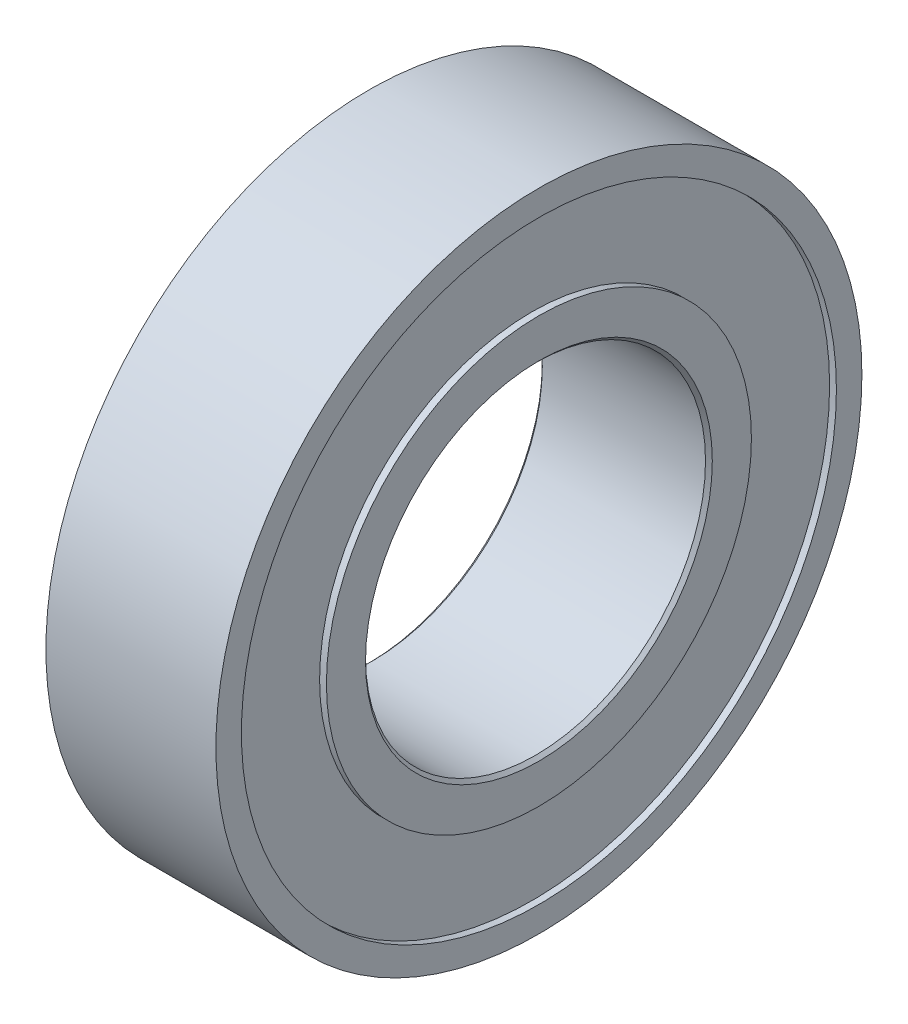
ISO-10303-21;
HEADER;
FILE_DESCRIPTION(('STEP AP214'),'2;1');
FILE_NAME('part.step','',(''),(''),'','','');
FILE_SCHEMA(('AUTOMOTIVE_DESIGN { 1 0 10303 214 1 1 1 1 }'));
ENDSEC;
DATA;
#1=APPLICATION_CONTEXT('core data for automotive mechanical design processes');
#2=APPLICATION_PROTOCOL_DEFINITION('international standard','automotive_design',2000,#1);
#3=PRODUCT_CONTEXT('',#1,'mechanical');
#4=PRODUCT('Part','Part','',(#3));
#5=PRODUCT_RELATED_PRODUCT_CATEGORY('part','',(#4));
#6=PRODUCT_DEFINITION_FORMATION('','',#4);
#7=PRODUCT_DEFINITION_CONTEXT('part definition',#1,'design');
#8=PRODUCT_DEFINITION('design','',#6,#7);
#9=PRODUCT_DEFINITION_SHAPE('','',#8);
#10=(LENGTH_UNIT() NAMED_UNIT(*) SI_UNIT(.MILLI.,.METRE.));
#11=(NAMED_UNIT(*) PLANE_ANGLE_UNIT() SI_UNIT($,.RADIAN.));
#12=(NAMED_UNIT(*) SI_UNIT($,.STERADIAN.) SOLID_ANGLE_UNIT());
#13=UNCERTAINTY_MEASURE_WITH_UNIT(LENGTH_MEASURE(1.E-05),#10,'distance_accuracy_value','');
#14=(GEOMETRIC_REPRESENTATION_CONTEXT(3) GLOBAL_UNCERTAINTY_ASSIGNED_CONTEXT((#13)) GLOBAL_UNIT_ASSIGNED_CONTEXT((#10,
#11,#12)) REPRESENTATION_CONTEXT('',''));
#15=CARTESIAN_POINT('',(0.,0.,0.));
#16=DIRECTION('',(0.,0.,1.));
#17=DIRECTION('',(1.,0.,0.));
#18=AXIS2_PLACEMENT_3D('',#15,#16,#17);
#19=CARTESIAN_POINT('',(5.,0.,0.));
#20=DIRECTION('',(1.,0.,0.));
#21=DIRECTION('',(0.,0.,-1.));
#22=AXIS2_PLACEMENT_3D('',#19,#20,#21);
#23=PLANE('',#22);
#24=CARTESIAN_POINT('',(5.,0.,0.));
#25=DIRECTION('',(1.,0.,0.));
#26=DIRECTION('',(0.,0.,-1.));
#27=AXIS2_PLACEMENT_3D('',#24,#25,#26);
#28=CIRCLE('',#27,5.1);
#29=CARTESIAN_POINT('',(5.,0.,-5.1));
#30=VERTEX_POINT('',#29);
#31=EDGE_CURVE('E10',#30,#30,#28,.F.);
#32=ORIENTED_EDGE('',*,*,#31,.T.);
#33=EDGE_LOOP('',(#32));
#34=FACE_BOUND('',#33,.T.);
#35=CARTESIAN_POINT('',(5.,0.,0.));
#36=DIRECTION('',(1.,0.,0.));
#37=DIRECTION('',(0.,0.,-1.));
#38=AXIS2_PLACEMENT_3D('',#35,#36,#37);
#39=CIRCLE('',#38,6.25);
#40=CARTESIAN_POINT('',(5.,0.,-6.25));
#41=VERTEX_POINT('',#40);
#42=EDGE_CURVE('E77',#41,#41,#39,.T.);
#43=ORIENTED_EDGE('',*,*,#42,.T.);
#44=EDGE_LOOP('',(#43));
#45=FACE_BOUND('',#44,.T.);
#46=ADVANCED_FACE('F32',(#34,#45),#23,.T.);
#47=CARTESIAN_POINT('',(0.,0.,0.));
#48=DIRECTION('',(1.,0.,0.));
#49=DIRECTION('',(0.,0.,-1.));
#50=AXIS2_PLACEMENT_3D('',#47,#48,#49);
#51=PLANE('',#50);
#52=CARTESIAN_POINT('',(0.,0.,0.));
#53=DIRECTION('',(1.,0.,0.));
#54=DIRECTION('',(0.,0.,-1.));
#55=AXIS2_PLACEMENT_3D('',#52,#53,#54);
#56=CIRCLE('',#55,5.1);
#57=CARTESIAN_POINT('',(0.,0.,-5.1));
#58=VERTEX_POINT('',#57);
#59=EDGE_CURVE('E47',#58,#58,#56,.T.);
#60=ORIENTED_EDGE('',*,*,#59,.T.);
#61=EDGE_LOOP('',(#60));
#62=FACE_BOUND('',#61,.T.);
#63=CARTESIAN_POINT('',(0.,0.,0.11164109505146));
#64=DIRECTION('',(-1.,0.,0.));
#65=DIRECTION('',(0.,0.,1.));
#66=AXIS2_PLACEMENT_3D('',#63,#64,#65);
#67=CIRCLE('',#66,6.25);
#68=CARTESIAN_POINT('',(0.,0.,6.36164109505146));
#69=VERTEX_POINT('',#68);
#70=EDGE_CURVE('E65',#69,#69,#67,.T.);
#71=ORIENTED_EDGE('',*,*,#70,.T.);
#72=EDGE_LOOP('',(#71));
#73=FACE_BOUND('',#72,.T.);
#74=ADVANCED_FACE('F103',(#62,#73),#51,.F.);
#75=CARTESIAN_POINT('',(5.,0.,0.));
#76=DIRECTION('',(1.,0.,0.));
#77=DIRECTION('',(0.,0.,-1.));
#78=AXIS2_PLACEMENT_3D('',#75,#76,#77);
#79=CIRCLE('',#78,8.75);
#80=CARTESIAN_POINT('',(5.,0.,-8.75));
#81=VERTEX_POINT('',#80);
#82=EDGE_CURVE('E71',#81,#81,#79,.T.);
#83=ORIENTED_EDGE('',*,*,#82,.F.);
#84=EDGE_LOOP('',(#83));
#85=FACE_BOUND('',#84,.T.);
#86=CARTESIAN_POINT('',(5.,0.,0.));
#87=DIRECTION('',(1.,0.,0.));
#88=DIRECTION('',(0.,0.,-1.));
#89=AXIS2_PLACEMENT_3D('',#86,#87,#88);
#90=CIRCLE('',#89,9.5);
#91=CARTESIAN_POINT('',(5.,0.,-9.5));
#92=VERTEX_POINT('',#91);
#93=EDGE_CURVE('E52',#92,#92,#90,.T.);
#94=ORIENTED_EDGE('',*,*,#93,.T.);
#95=EDGE_LOOP('',(#94));
#96=FACE_BOUND('',#95,.T.);
#97=ADVANCED_FACE('F99',(#85,#96),#23,.T.);
#98=CARTESIAN_POINT('',(0.,0.,0.11164109505146));
#99=DIRECTION('',(-1.,0.,0.));
#100=DIRECTION('',(0.,0.,1.));
#101=AXIS2_PLACEMENT_3D('',#98,#99,#100);
#102=CIRCLE('',#101,8.25);
#103=CARTESIAN_POINT('',(0.,0.,8.36164109505146));
#104=VERTEX_POINT('',#103);
#105=EDGE_CURVE('E59',#104,#104,#102,.T.);
#106=ORIENTED_EDGE('',*,*,#105,.F.);
#107=EDGE_LOOP('',(#106));
#108=FACE_BOUND('',#107,.T.);
#109=CARTESIAN_POINT('',(0.,0.,0.));
#110=DIRECTION('',(1.,0.,0.));
#111=DIRECTION('',(0.,0.,-1.));
#112=AXIS2_PLACEMENT_3D('',#109,#110,#111);
#113=CIRCLE('',#112,9.5);
#114=CARTESIAN_POINT('',(0.,0.,-9.5));
#115=VERTEX_POINT('',#114);
#116=EDGE_CURVE('E53',#115,#115,#113,.T.);
#117=ORIENTED_EDGE('',*,*,#116,.F.);
#118=EDGE_LOOP('',(#117));
#119=FACE_BOUND('',#118,.T.);
#120=ADVANCED_FACE('F102',(#108,#119),#51,.F.);
#121=CARTESIAN_POINT('',(5.,0.,0.));
#122=DIRECTION('',(-1.,0.,0.));
#123=DIRECTION('',(0.,0.,1.));
#124=AXIS2_PLACEMENT_3D('',#121,#122,#123);
#125=CYLINDRICAL_SURFACE('',#124,9.5);
#126=ORIENTED_EDGE('',*,*,#93,.F.);
#127=EDGE_LOOP('',(#126));
#128=FACE_BOUND('',#127,.T.);
#129=ORIENTED_EDGE('',*,*,#116,.T.);
#130=EDGE_LOOP('',(#129));
#131=FACE_BOUND('',#130,.T.);
#132=ADVANCED_FACE('F107',(#128,#131),#125,.T.);
#133=CARTESIAN_POINT('',(5.,0.,0.));
#134=DIRECTION('',(-1.,0.,0.));
#135=DIRECTION('',(0.,0.,1.));
#136=AXIS2_PLACEMENT_3D('',#133,#134,#135);
#137=CYLINDRICAL_SURFACE('',#136,5.);
#138=CARTESIAN_POINT('',(0.0999999999999977,0.,0.));
#139=DIRECTION('',(1.,0.,0.));
#140=DIRECTION('',(0.,0.,-1.));
#141=AXIS2_PLACEMENT_3D('',#138,#139,#140);
#142=CIRCLE('',#141,5.);
#143=CARTESIAN_POINT('',(0.0999999999999977,0.,-5.));
#144=VERTEX_POINT('',#143);
#145=EDGE_CURVE('E39',#144,#144,#142,.F.);
#146=ORIENTED_EDGE('',*,*,#145,.T.);
#147=EDGE_LOOP('',(#146));
#148=FACE_BOUND('',#147,.T.);
#149=CARTESIAN_POINT('',(4.9,0.,0.));
#150=DIRECTION('',(1.,0.,0.));
#151=DIRECTION('',(0.,0.,-1.));
#152=AXIS2_PLACEMENT_3D('',#149,#150,#151);
#153=CIRCLE('',#152,5.);
#154=CARTESIAN_POINT('',(4.9,0.,-5.));
#155=VERTEX_POINT('',#154);
#156=EDGE_CURVE('E43',#155,#155,#153,.T.);
#157=ORIENTED_EDGE('',*,*,#156,.T.);
#158=EDGE_LOOP('',(#157));
#159=FACE_BOUND('',#158,.T.);
#160=ADVANCED_FACE('F110',(#148,#159),#137,.F.);
#161=CARTESIAN_POINT('',(0.2,0.,0.11164109505146));
#162=DIRECTION('',(-1.,0.,0.));
#163=DIRECTION('',(0.,0.,1.));
#164=AXIS2_PLACEMENT_3D('',#161,#162,#163);
#165=CYLINDRICAL_SURFACE('',#164,8.25);
#166=CARTESIAN_POINT('',(0.2,0.,0.11164109505146));
#167=DIRECTION('',(-1.,0.,0.));
#168=DIRECTION('',(0.,0.,1.));
#169=AXIS2_PLACEMENT_3D('',#166,#167,#168);
#170=CIRCLE('',#169,8.25);
#171=CARTESIAN_POINT('',(0.2,0.,8.36164109505146));
#172=VERTEX_POINT('',#171);
#173=EDGE_CURVE('E56',#172,#172,#170,.T.);
#174=ORIENTED_EDGE('',*,*,#173,.F.);
#175=EDGE_LOOP('',(#174));
#176=FACE_BOUND('',#175,.T.);
#177=ORIENTED_EDGE('',*,*,#105,.T.);
#178=EDGE_LOOP('',(#177));
#179=FACE_BOUND('',#178,.T.);
#180=ADVANCED_FACE('F129',(#176,#179),#165,.F.);
#181=CARTESIAN_POINT('',(0.2,0.,0.11164109505146));
#182=DIRECTION('',(-1.,0.,0.));
#183=DIRECTION('',(0.,0.,1.));
#184=AXIS2_PLACEMENT_3D('',#181,#182,#183);
#185=PLANE('',#184);
#186=CARTESIAN_POINT('',(0.2,0.,0.11164109505146));
#187=DIRECTION('',(-1.,0.,0.));
#188=DIRECTION('',(0.,0.,1.));
#189=AXIS2_PLACEMENT_3D('',#186,#187,#188);
#190=CIRCLE('',#189,6.25);
#191=CARTESIAN_POINT('',(0.2,0.,6.36164109505146));
#192=VERTEX_POINT('',#191);
#193=EDGE_CURVE('E62',#192,#192,#190,.T.);
#194=ORIENTED_EDGE('',*,*,#193,.F.);
#195=EDGE_LOOP('',(#194));
#196=FACE_BOUND('',#195,.T.);
#197=ORIENTED_EDGE('',*,*,#173,.T.);
#198=EDGE_LOOP('',(#197));
#199=FACE_BOUND('',#198,.T.);
#200=ADVANCED_FACE('F132',(#196,#199),#185,.T.);
#201=CARTESIAN_POINT('',(0.2,0.,0.11164109505146));
#202=DIRECTION('',(-1.,0.,0.));
#203=DIRECTION('',(0.,0.,1.));
#204=AXIS2_PLACEMENT_3D('',#201,#202,#203);
#205=CYLINDRICAL_SURFACE('',#204,6.25);
#206=ORIENTED_EDGE('',*,*,#193,.T.);
#207=EDGE_LOOP('',(#206));
#208=FACE_BOUND('',#207,.T.);
#209=ORIENTED_EDGE('',*,*,#70,.F.);
#210=EDGE_LOOP('',(#209));
#211=FACE_BOUND('',#210,.T.);
#212=ADVANCED_FACE('F95',(#208,#211),#205,.T.);
#213=CARTESIAN_POINT('',(4.8,0.,0.));
#214=DIRECTION('',(1.,0.,0.));
#215=DIRECTION('',(0.,0.,-1.));
#216=AXIS2_PLACEMENT_3D('',#213,#214,#215);
#217=CYLINDRICAL_SURFACE('',#216,8.75);
#218=CARTESIAN_POINT('',(4.8,0.,0.));
#219=DIRECTION('',(1.,0.,0.));
#220=DIRECTION('',(0.,0.,-1.));
#221=AXIS2_PLACEMENT_3D('',#218,#219,#220);
#222=CIRCLE('',#221,8.75);
#223=CARTESIAN_POINT('',(4.8,0.,-8.75));
#224=VERTEX_POINT('',#223);
#225=EDGE_CURVE('E68',#224,#224,#222,.T.);
#226=ORIENTED_EDGE('',*,*,#225,.F.);
#227=EDGE_LOOP('',(#226));
#228=FACE_BOUND('',#227,.T.);
#229=ORIENTED_EDGE('',*,*,#82,.T.);
#230=EDGE_LOOP('',(#229));
#231=FACE_BOUND('',#230,.T.);
#232=ADVANCED_FACE('F89',(#228,#231),#217,.F.);
#233=CARTESIAN_POINT('',(4.8,0.,0.));
#234=DIRECTION('',(1.,0.,0.));
#235=DIRECTION('',(0.,0.,-1.));
#236=AXIS2_PLACEMENT_3D('',#233,#234,#235);
#237=PLANE('',#236);
#238=CARTESIAN_POINT('',(4.8,0.,0.));
#239=DIRECTION('',(1.,0.,0.));
#240=DIRECTION('',(0.,0.,-1.));
#241=AXIS2_PLACEMENT_3D('',#238,#239,#240);
#242=CIRCLE('',#241,6.25);
#243=CARTESIAN_POINT('',(4.8,0.,-6.25));
#244=VERTEX_POINT('',#243);
#245=EDGE_CURVE('E74',#244,#244,#242,.T.);
#246=ORIENTED_EDGE('',*,*,#245,.F.);
#247=EDGE_LOOP('',(#246));
#248=FACE_BOUND('',#247,.T.);
#249=ORIENTED_EDGE('',*,*,#225,.T.);
#250=EDGE_LOOP('',(#249));
#251=FACE_BOUND('',#250,.T.);
#252=ADVANCED_FACE('F86',(#248,#251),#237,.T.);
#253=CARTESIAN_POINT('',(4.8,0.,0.));
#254=DIRECTION('',(1.,0.,0.));
#255=DIRECTION('',(0.,0.,-1.));
#256=AXIS2_PLACEMENT_3D('',#253,#254,#255);
#257=CYLINDRICAL_SURFACE('',#256,6.25);
#258=ORIENTED_EDGE('',*,*,#245,.T.);
#259=EDGE_LOOP('',(#258));
#260=FACE_BOUND('',#259,.T.);
#261=ORIENTED_EDGE('',*,*,#42,.F.);
#262=EDGE_LOOP('',(#261));
#263=FACE_BOUND('',#262,.T.);
#264=ADVANCED_FACE('F83',(#260,#263),#257,.T.);
#265=CARTESIAN_POINT('',(0.,0.,0.));
#266=DIRECTION('',(-1.,0.,0.));
#267=DIRECTION('',(0.,0.,1.));
#268=AXIS2_PLACEMENT_3D('',#265,#266,#267);
#269=CONICAL_SURFACE('',#268,5.1,0.785398163397444);
#270=ORIENTED_EDGE('',*,*,#145,.F.);
#271=EDGE_LOOP('',(#270));
#272=FACE_BOUND('',#271,.T.);
#273=ORIENTED_EDGE('',*,*,#59,.F.);
#274=EDGE_LOOP('',(#273));
#275=FACE_BOUND('',#274,.T.);
#276=ADVANCED_FACE('F141',(#272,#275),#269,.F.);
#277=CARTESIAN_POINT('',(4.9,0.,0.));
#278=DIRECTION('',(1.,0.,0.));
#279=DIRECTION('',(0.,0.,-1.));
#280=AXIS2_PLACEMENT_3D('',#277,#278,#279);
#281=CONICAL_SURFACE('',#280,5.,0.785398163397435);
#282=ORIENTED_EDGE('',*,*,#31,.F.);
#283=EDGE_LOOP('',(#282));
#284=FACE_BOUND('',#283,.T.);
#285=ORIENTED_EDGE('',*,*,#156,.F.);
#286=EDGE_LOOP('',(#285));
#287=FACE_BOUND('',#286,.T.);
#288=ADVANCED_FACE('F34',(#284,#287),#281,.F.);
#289=CLOSED_SHELL('',(#46,#74,#97,#120,#132,#160,#180,#200,#212,#232,#252,#264,#276,#288));
#290=MANIFOLD_SOLID_BREP('B2',#289);
#291=ADVANCED_BREP_SHAPE_REPRESENTATION('',(#18,#290),#14);
#292=SHAPE_DEFINITION_REPRESENTATION(#9,#291);
ENDSEC;
END-ISO-10303-21;
